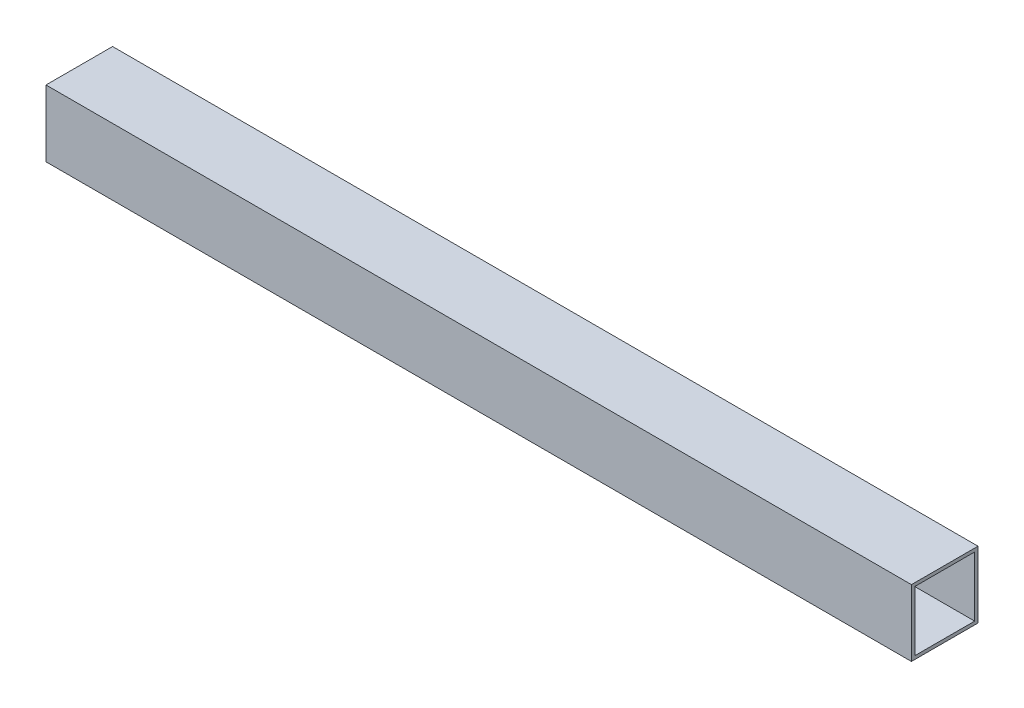
ISO-10303-21;
HEADER;
FILE_DESCRIPTION(('STEP AP214'),'2;1');
FILE_NAME('part.step','',(''),(''),'','','');
FILE_SCHEMA(('AUTOMOTIVE_DESIGN { 1 0 10303 214 1 1 1 1 }'));
ENDSEC;
DATA;
#1=APPLICATION_CONTEXT('core data for automotive mechanical design processes');
#2=APPLICATION_PROTOCOL_DEFINITION('international standard','automotive_design',2000,#1);
#3=PRODUCT_CONTEXT('',#1,'mechanical');
#4=PRODUCT('Part','Part','',(#3));
#5=PRODUCT_RELATED_PRODUCT_CATEGORY('part','',(#4));
#6=PRODUCT_DEFINITION_FORMATION('','',#4);
#7=PRODUCT_DEFINITION_CONTEXT('part definition',#1,'design');
#8=PRODUCT_DEFINITION('design','',#6,#7);
#9=PRODUCT_DEFINITION_SHAPE('','',#8);
#10=(LENGTH_UNIT() NAMED_UNIT(*) SI_UNIT(.MILLI.,.METRE.));
#11=(NAMED_UNIT(*) PLANE_ANGLE_UNIT() SI_UNIT($,.RADIAN.));
#12=(NAMED_UNIT(*) SI_UNIT($,.STERADIAN.) SOLID_ANGLE_UNIT());
#13=UNCERTAINTY_MEASURE_WITH_UNIT(LENGTH_MEASURE(1.E-05),#10,'distance_accuracy_value','');
#14=(GEOMETRIC_REPRESENTATION_CONTEXT(3) GLOBAL_UNCERTAINTY_ASSIGNED_CONTEXT((#13)) GLOBAL_UNIT_ASSIGNED_CONTEXT((#10,
#11,#12)) REPRESENTATION_CONTEXT('',''));
#15=CARTESIAN_POINT('',(0.,0.,0.));
#16=DIRECTION('',(0.,0.,1.));
#17=DIRECTION('',(1.,0.,0.));
#18=AXIS2_PLACEMENT_3D('',#15,#16,#17);
#19=CARTESIAN_POINT('',(520.,0.,0.));
#20=DIRECTION('',(-1.,0.,0.));
#21=DIRECTION('',(0.,0.,1.));
#22=AXIS2_PLACEMENT_3D('',#19,#20,#21);
#23=PLANE('',#22);
#24=DIRECTION('',(0.,1.,0.));
#25=VECTOR('',#24,1.);
#26=CARTESIAN_POINT('',(520.,-20.,-20.));
#27=LINE('',#26,#25);
#28=CARTESIAN_POINT('',(520.,-20.,-20.));
#29=VERTEX_POINT('',#28);
#30=CARTESIAN_POINT('',(520.,20.,-20.));
#31=VERTEX_POINT('',#30);
#32=EDGE_CURVE('E133',#29,#31,#27,.T.);
#33=ORIENTED_EDGE('',*,*,#32,.T.);
#34=DIRECTION('',(0.,0.,1.));
#35=VECTOR('',#34,1.);
#36=CARTESIAN_POINT('',(520.,20.,20.));
#37=LINE('',#36,#35);
#38=CARTESIAN_POINT('',(520.,20.,20.));
#39=VERTEX_POINT('',#38);
#40=EDGE_CURVE('E136',#31,#39,#37,.T.);
#41=ORIENTED_EDGE('',*,*,#40,.T.);
#42=DIRECTION('',(0.,-1.,0.));
#43=VECTOR('',#42,1.);
#44=CARTESIAN_POINT('',(520.,-20.,20.));
#45=LINE('',#44,#43);
#46=CARTESIAN_POINT('',(520.,-20.,20.));
#47=VERTEX_POINT('',#46);
#48=EDGE_CURVE('E139',#39,#47,#45,.T.);
#49=ORIENTED_EDGE('',*,*,#48,.T.);
#50=DIRECTION('',(0.,0.,-1.));
#51=VECTOR('',#50,1.);
#52=CARTESIAN_POINT('',(520.,-20.,20.));
#53=LINE('',#52,#51);
#54=EDGE_CURVE('E141',#47,#29,#53,.T.);
#55=ORIENTED_EDGE('',*,*,#54,.T.);
#56=EDGE_LOOP('',(#33,#41,#49,#55));
#57=FACE_BOUND('',#56,.T.);
#58=DIRECTION('',(0.,1.,0.));
#59=VECTOR('',#58,1.);
#60=CARTESIAN_POINT('',(520.,-18.,-18.));
#61=LINE('',#60,#59);
#62=CARTESIAN_POINT('',(520.,-18.,-18.));
#63=VERTEX_POINT('',#62);
#64=CARTESIAN_POINT('',(520.,18.,-18.));
#65=VERTEX_POINT('',#64);
#66=EDGE_CURVE('E97',#63,#65,#61,.T.);
#67=ORIENTED_EDGE('',*,*,#66,.F.);
#68=DIRECTION('',(0.,0.,-1.));
#69=VECTOR('',#68,1.);
#70=CARTESIAN_POINT('',(520.,-18.,18.));
#71=LINE('',#70,#69);
#72=CARTESIAN_POINT('',(520.,-18.,18.));
#73=VERTEX_POINT('',#72);
#74=EDGE_CURVE('E119',#73,#63,#71,.T.);
#75=ORIENTED_EDGE('',*,*,#74,.F.);
#76=DIRECTION('',(0.,-1.,0.));
#77=VECTOR('',#76,1.);
#78=CARTESIAN_POINT('',(520.,-18.,18.));
#79=LINE('',#78,#77);
#80=CARTESIAN_POINT('',(520.,18.,18.));
#81=VERTEX_POINT('',#80);
#82=EDGE_CURVE('E117',#81,#73,#79,.T.);
#83=ORIENTED_EDGE('',*,*,#82,.F.);
#84=DIRECTION('',(0.,0.,1.));
#85=VECTOR('',#84,1.);
#86=CARTESIAN_POINT('',(520.,18.,18.));
#87=LINE('',#86,#85);
#88=EDGE_CURVE('E105',#65,#81,#87,.T.);
#89=ORIENTED_EDGE('',*,*,#88,.F.);
#90=EDGE_LOOP('',(#67,#75,#83,#89));
#91=FACE_BOUND('',#90,.T.);
#92=ADVANCED_FACE('F32',(#57,#91),#23,.F.);
#93=CARTESIAN_POINT('',(0.,0.,0.));
#94=DIRECTION('',(-1.,0.,0.));
#95=DIRECTION('',(0.,0.,1.));
#96=AXIS2_PLACEMENT_3D('',#93,#94,#95);
#97=PLANE('',#96);
#98=DIRECTION('',(0.,1.,0.));
#99=VECTOR('',#98,1.);
#100=CARTESIAN_POINT('',(0.,-20.,-20.));
#101=LINE('',#100,#99);
#102=CARTESIAN_POINT('',(0.,-20.,-20.));
#103=VERTEX_POINT('',#102);
#104=CARTESIAN_POINT('',(0.,20.,-20.));
#105=VERTEX_POINT('',#104);
#106=EDGE_CURVE('E113',#103,#105,#101,.T.);
#107=ORIENTED_EDGE('',*,*,#106,.F.);
#108=DIRECTION('',(0.,0.,-1.));
#109=VECTOR('',#108,1.);
#110=CARTESIAN_POINT('',(0.,-20.,20.));
#111=LINE('',#110,#109);
#112=CARTESIAN_POINT('',(0.,-20.,20.));
#113=VERTEX_POINT('',#112);
#114=EDGE_CURVE('E137',#113,#103,#111,.T.);
#115=ORIENTED_EDGE('',*,*,#114,.F.);
#116=DIRECTION('',(0.,-1.,0.));
#117=VECTOR('',#116,1.);
#118=CARTESIAN_POINT('',(0.,-20.,20.));
#119=LINE('',#118,#117);
#120=CARTESIAN_POINT('',(0.,20.,20.));
#121=VERTEX_POINT('',#120);
#122=EDGE_CURVE('E148',#121,#113,#119,.T.);
#123=ORIENTED_EDGE('',*,*,#122,.F.);
#124=DIRECTION('',(0.,0.,1.));
#125=VECTOR('',#124,1.);
#126=CARTESIAN_POINT('',(0.,20.,20.));
#127=LINE('',#126,#125);
#128=EDGE_CURVE('E146',#105,#121,#127,.T.);
#129=ORIENTED_EDGE('',*,*,#128,.F.);
#130=EDGE_LOOP('',(#107,#115,#123,#129));
#131=FACE_BOUND('',#130,.T.);
#132=DIRECTION('',(0.,0.,-1.));
#133=VECTOR('',#132,1.);
#134=CARTESIAN_POINT('',(0.,-18.,18.));
#135=LINE('',#134,#133);
#136=CARTESIAN_POINT('',(0.,-18.,18.));
#137=VERTEX_POINT('',#136);
#138=CARTESIAN_POINT('',(0.,-18.,-18.));
#139=VERTEX_POINT('',#138);
#140=EDGE_CURVE('E106',#137,#139,#135,.T.);
#141=ORIENTED_EDGE('',*,*,#140,.T.);
#142=DIRECTION('',(0.,1.,0.));
#143=VECTOR('',#142,1.);
#144=CARTESIAN_POINT('',(0.,-18.,-18.));
#145=LINE('',#144,#143);
#146=CARTESIAN_POINT('',(0.,18.,-18.));
#147=VERTEX_POINT('',#146);
#148=EDGE_CURVE('E55',#139,#147,#145,.T.);
#149=ORIENTED_EDGE('',*,*,#148,.T.);
#150=DIRECTION('',(0.,0.,1.));
#151=VECTOR('',#150,1.);
#152=CARTESIAN_POINT('',(0.,18.,18.));
#153=LINE('',#152,#151);
#154=CARTESIAN_POINT('',(0.,18.,18.));
#155=VERTEX_POINT('',#154);
#156=EDGE_CURVE('E112',#147,#155,#153,.T.);
#157=ORIENTED_EDGE('',*,*,#156,.T.);
#158=DIRECTION('',(0.,-1.,0.));
#159=VECTOR('',#158,1.);
#160=CARTESIAN_POINT('',(0.,-18.,18.));
#161=LINE('',#160,#159);
#162=EDGE_CURVE('E125',#155,#137,#161,.T.);
#163=ORIENTED_EDGE('',*,*,#162,.T.);
#164=EDGE_LOOP('',(#141,#149,#157,#163));
#165=FACE_BOUND('',#164,.T.);
#166=ADVANCED_FACE('F166',(#131,#165),#97,.T.);
#167=CARTESIAN_POINT('',(520.,-20.,-20.));
#168=DIRECTION('',(0.,0.,1.));
#169=DIRECTION('',(1.,0.,0.));
#170=AXIS2_PLACEMENT_3D('',#167,#168,#169);
#171=PLANE('',#170);
#172=ORIENTED_EDGE('',*,*,#106,.T.);
#173=DIRECTION('',(-1.,0.,0.));
#174=VECTOR('',#173,1.);
#175=CARTESIAN_POINT('',(520.,20.,-20.));
#176=LINE('',#175,#174);
#177=EDGE_CURVE('E11',#31,#105,#176,.T.);
#178=ORIENTED_EDGE('',*,*,#177,.F.);
#179=ORIENTED_EDGE('',*,*,#32,.F.);
#180=DIRECTION('',(-1.,0.,0.));
#181=VECTOR('',#180,1.);
#182=CARTESIAN_POINT('',(520.,-20.,-20.));
#183=LINE('',#182,#181);
#184=EDGE_CURVE('E143',#29,#103,#183,.T.);
#185=ORIENTED_EDGE('',*,*,#184,.T.);
#186=EDGE_LOOP('',(#172,#178,#179,#185));
#187=FACE_BOUND('',#186,.T.);
#188=ADVANCED_FACE('F34',(#187),#171,.F.);
#189=CARTESIAN_POINT('',(520.,20.,20.));
#190=DIRECTION('',(0.,-1.,0.));
#191=DIRECTION('',(0.,0.,-1.));
#192=AXIS2_PLACEMENT_3D('',#189,#190,#191);
#193=PLANE('',#192);
#194=ORIENTED_EDGE('',*,*,#128,.T.);
#195=DIRECTION('',(-1.,0.,0.));
#196=VECTOR('',#195,1.);
#197=CARTESIAN_POINT('',(520.,20.,20.));
#198=LINE('',#197,#196);
#199=EDGE_CURVE('E40',#39,#121,#198,.T.);
#200=ORIENTED_EDGE('',*,*,#199,.F.);
#201=ORIENTED_EDGE('',*,*,#40,.F.);
#202=ORIENTED_EDGE('',*,*,#177,.T.);
#203=EDGE_LOOP('',(#194,#200,#201,#202));
#204=FACE_BOUND('',#203,.T.);
#205=ADVANCED_FACE('F176',(#204),#193,.F.);
#206=CARTESIAN_POINT('',(520.,-20.,20.));
#207=DIRECTION('',(0.,0.,-1.));
#208=DIRECTION('',(-1.,0.,0.));
#209=AXIS2_PLACEMENT_3D('',#206,#207,#208);
#210=PLANE('',#209);
#211=ORIENTED_EDGE('',*,*,#122,.T.);
#212=DIRECTION('',(-1.,0.,0.));
#213=VECTOR('',#212,1.);
#214=CARTESIAN_POINT('',(520.,-20.,20.));
#215=LINE('',#214,#213);
#216=EDGE_CURVE('E153',#47,#113,#215,.T.);
#217=ORIENTED_EDGE('',*,*,#216,.F.);
#218=ORIENTED_EDGE('',*,*,#48,.F.);
#219=ORIENTED_EDGE('',*,*,#199,.T.);
#220=EDGE_LOOP('',(#211,#217,#218,#219));
#221=FACE_BOUND('',#220,.T.);
#222=ADVANCED_FACE('F160',(#221),#210,.F.);
#223=CARTESIAN_POINT('',(520.,-20.,20.));
#224=DIRECTION('',(0.,1.,0.));
#225=DIRECTION('',(0.,0.,1.));
#226=AXIS2_PLACEMENT_3D('',#223,#224,#225);
#227=PLANE('',#226);
#228=ORIENTED_EDGE('',*,*,#114,.T.);
#229=ORIENTED_EDGE('',*,*,#184,.F.);
#230=ORIENTED_EDGE('',*,*,#54,.F.);
#231=ORIENTED_EDGE('',*,*,#216,.T.);
#232=EDGE_LOOP('',(#228,#229,#230,#231));
#233=FACE_BOUND('',#232,.T.);
#234=ADVANCED_FACE('F170',(#233),#227,.F.);
#235=CARTESIAN_POINT('',(520.,-18.,-18.));
#236=DIRECTION('',(0.,0.,1.));
#237=DIRECTION('',(1.,0.,0.));
#238=AXIS2_PLACEMENT_3D('',#235,#236,#237);
#239=PLANE('',#238);
#240=ORIENTED_EDGE('',*,*,#148,.F.);
#241=DIRECTION('',(-1.,0.,0.));
#242=VECTOR('',#241,1.);
#243=CARTESIAN_POINT('',(520.,-18.,-18.));
#244=LINE('',#243,#242);
#245=EDGE_CURVE('E101',#63,#139,#244,.T.);
#246=ORIENTED_EDGE('',*,*,#245,.F.);
#247=ORIENTED_EDGE('',*,*,#66,.T.);
#248=DIRECTION('',(-1.,0.,0.));
#249=VECTOR('',#248,1.);
#250=CARTESIAN_POINT('',(520.,18.,-18.));
#251=LINE('',#250,#249);
#252=EDGE_CURVE('E100',#65,#147,#251,.T.);
#253=ORIENTED_EDGE('',*,*,#252,.T.);
#254=EDGE_LOOP('',(#240,#246,#247,#253));
#255=FACE_BOUND('',#254,.T.);
#256=ADVANCED_FACE('F99',(#255),#239,.T.);
#257=CARTESIAN_POINT('',(520.,18.,18.));
#258=DIRECTION('',(0.,-1.,0.));
#259=DIRECTION('',(0.,0.,-1.));
#260=AXIS2_PLACEMENT_3D('',#257,#258,#259);
#261=PLANE('',#260);
#262=ORIENTED_EDGE('',*,*,#156,.F.);
#263=ORIENTED_EDGE('',*,*,#252,.F.);
#264=ORIENTED_EDGE('',*,*,#88,.T.);
#265=DIRECTION('',(-1.,0.,0.));
#266=VECTOR('',#265,1.);
#267=CARTESIAN_POINT('',(520.,18.,18.));
#268=LINE('',#267,#266);
#269=EDGE_CURVE('E114',#81,#155,#268,.T.);
#270=ORIENTED_EDGE('',*,*,#269,.T.);
#271=EDGE_LOOP('',(#262,#263,#264,#270));
#272=FACE_BOUND('',#271,.T.);
#273=ADVANCED_FACE('F109',(#272),#261,.T.);
#274=CARTESIAN_POINT('',(520.,-18.,18.));
#275=DIRECTION('',(0.,0.,-1.));
#276=DIRECTION('',(-1.,0.,0.));
#277=AXIS2_PLACEMENT_3D('',#274,#275,#276);
#278=PLANE('',#277);
#279=ORIENTED_EDGE('',*,*,#162,.F.);
#280=ORIENTED_EDGE('',*,*,#269,.F.);
#281=ORIENTED_EDGE('',*,*,#82,.T.);
#282=DIRECTION('',(-1.,0.,0.));
#283=VECTOR('',#282,1.);
#284=CARTESIAN_POINT('',(520.,-18.,18.));
#285=LINE('',#284,#283);
#286=EDGE_CURVE('E47',#73,#137,#285,.T.);
#287=ORIENTED_EDGE('',*,*,#286,.T.);
#288=EDGE_LOOP('',(#279,#280,#281,#287));
#289=FACE_BOUND('',#288,.T.);
#290=ADVANCED_FACE('F199',(#289),#278,.T.);
#291=CARTESIAN_POINT('',(520.,-18.,18.));
#292=DIRECTION('',(0.,1.,0.));
#293=DIRECTION('',(0.,0.,1.));
#294=AXIS2_PLACEMENT_3D('',#291,#292,#293);
#295=PLANE('',#294);
#296=ORIENTED_EDGE('',*,*,#140,.F.);
#297=ORIENTED_EDGE('',*,*,#286,.F.);
#298=ORIENTED_EDGE('',*,*,#74,.T.);
#299=ORIENTED_EDGE('',*,*,#245,.T.);
#300=EDGE_LOOP('',(#296,#297,#298,#299));
#301=FACE_BOUND('',#300,.T.);
#302=ADVANCED_FACE('F203',(#301),#295,.T.);
#303=CLOSED_SHELL('',(#92,#166,#188,#205,#222,#234,#256,#273,#290,#302));
#304=MANIFOLD_SOLID_BREP('B2',#303);
#305=ADVANCED_BREP_SHAPE_REPRESENTATION('',(#18,#304),#14);
#306=SHAPE_DEFINITION_REPRESENTATION(#9,#305);
ENDSEC;
END-ISO-10303-21;
